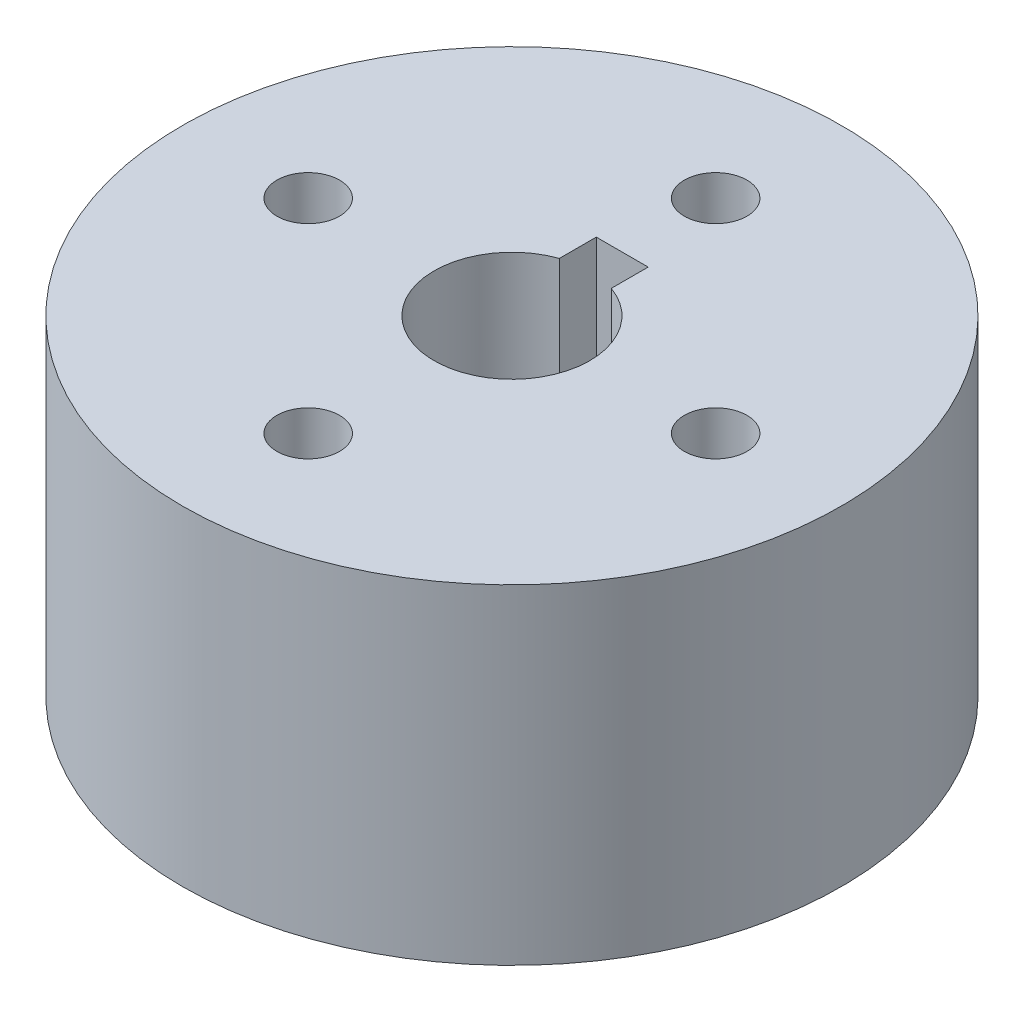
ISO-10303-21;
HEADER;
FILE_DESCRIPTION(('STEP AP214'),'2;1');
FILE_NAME('part.step','',(''),(''),'','','');
FILE_SCHEMA(('AUTOMOTIVE_DESIGN { 1 0 10303 214 1 1 1 1 }'));
ENDSEC;
DATA;
#1=APPLICATION_CONTEXT('core data for automotive mechanical design processes');
#2=APPLICATION_PROTOCOL_DEFINITION('international standard','automotive_design',2000,#1);
#3=PRODUCT_CONTEXT('',#1,'mechanical');
#4=PRODUCT('Part','Part','',(#3));
#5=PRODUCT_RELATED_PRODUCT_CATEGORY('part','',(#4));
#6=PRODUCT_DEFINITION_FORMATION('','',#4);
#7=PRODUCT_DEFINITION_CONTEXT('part definition',#1,'design');
#8=PRODUCT_DEFINITION('design','',#6,#7);
#9=PRODUCT_DEFINITION_SHAPE('','',#8);
#10=(LENGTH_UNIT() NAMED_UNIT(*) SI_UNIT(.MILLI.,.METRE.));
#11=(NAMED_UNIT(*) PLANE_ANGLE_UNIT() SI_UNIT($,.RADIAN.));
#12=(NAMED_UNIT(*) SI_UNIT($,.STERADIAN.) SOLID_ANGLE_UNIT());
#13=UNCERTAINTY_MEASURE_WITH_UNIT(LENGTH_MEASURE(1.E-05),#10,'distance_accuracy_value','');
#14=(GEOMETRIC_REPRESENTATION_CONTEXT(3) GLOBAL_UNCERTAINTY_ASSIGNED_CONTEXT((#13)) GLOBAL_UNIT_ASSIGNED_CONTEXT((#10,
#11,#12)) REPRESENTATION_CONTEXT('',''));
#15=CARTESIAN_POINT('',(0.,0.,0.));
#16=DIRECTION('',(0.,0.,1.));
#17=DIRECTION('',(1.,0.,0.));
#18=AXIS2_PLACEMENT_3D('',#15,#16,#17);
#19=CARTESIAN_POINT('',(0.,25.4,0.));
#20=DIRECTION('',(0.,1.,0.));
#21=DIRECTION('',(0.,0.,1.));
#22=AXIS2_PLACEMENT_3D('',#19,#20,#21);
#23=PLANE('',#22);
#24=CARTESIAN_POINT('',(0.,25.4,-15.7));
#25=DIRECTION('',(0.,-1.,0.));
#26=DIRECTION('',(0.,0.,-1.));
#27=AXIS2_PLACEMENT_3D('',#24,#25,#26);
#28=CIRCLE('',#27,2.413);
#29=CARTESIAN_POINT('',(0.,25.4,-18.113));
#30=VERTEX_POINT('',#29);
#31=EDGE_CURVE('E105',#30,#30,#28,.T.);
#32=ORIENTED_EDGE('',*,*,#31,.T.);
#33=EDGE_LOOP('',(#32));
#34=FACE_BOUND('',#33,.T.);
#35=CARTESIAN_POINT('',(-15.7,25.4,0.));
#36=DIRECTION('',(0.,-1.,0.));
#37=DIRECTION('',(0.,0.,-1.));
#38=AXIS2_PLACEMENT_3D('',#35,#36,#37);
#39=CIRCLE('',#38,2.413);
#40=CARTESIAN_POINT('',(-15.7,25.4,-2.413));
#41=VERTEX_POINT('',#40);
#42=EDGE_CURVE('E163',#41,#41,#39,.T.);
#43=ORIENTED_EDGE('',*,*,#42,.T.);
#44=EDGE_LOOP('',(#43));
#45=FACE_BOUND('',#44,.T.);
#46=CARTESIAN_POINT('',(0.,25.4,15.7));
#47=DIRECTION('',(0.,-1.,0.));
#48=DIRECTION('',(0.,0.,-1.));
#49=AXIS2_PLACEMENT_3D('',#46,#47,#48);
#50=CIRCLE('',#49,2.413);
#51=CARTESIAN_POINT('',(0.,25.4,13.287));
#52=VERTEX_POINT('',#51);
#53=EDGE_CURVE('E155',#52,#52,#50,.T.);
#54=ORIENTED_EDGE('',*,*,#53,.T.);
#55=EDGE_LOOP('',(#54));
#56=FACE_BOUND('',#55,.T.);
#57=CARTESIAN_POINT('',(15.7,25.4,0.));
#58=DIRECTION('',(0.,-1.,0.));
#59=DIRECTION('',(0.,0.,-1.));
#60=AXIS2_PLACEMENT_3D('',#57,#58,#59);
#61=CIRCLE('',#60,2.413);
#62=CARTESIAN_POINT('',(15.7,25.4,-2.413));
#63=VERTEX_POINT('',#62);
#64=EDGE_CURVE('E147',#63,#63,#61,.T.);
#65=ORIENTED_EDGE('',*,*,#64,.T.);
#66=EDGE_LOOP('',(#65));
#67=FACE_BOUND('',#66,.T.);
#68=DIRECTION('',(0.,0.,1.));
#69=VECTOR('',#68,1.);
#70=CARTESIAN_POINT('',(-2.,25.4,-8.5));
#71=LINE('',#70,#69);
#72=CARTESIAN_POINT('',(-2.,25.4,-8.5));
#73=VERTEX_POINT('',#72);
#74=CARTESIAN_POINT('',(-2.,25.4,-5.65685424949238));
#75=VERTEX_POINT('',#74);
#76=EDGE_CURVE('E102',#73,#75,#71,.T.);
#77=ORIENTED_EDGE('',*,*,#76,.F.);
#78=DIRECTION('',(-1.,0.,0.));
#79=VECTOR('',#78,1.);
#80=CARTESIAN_POINT('',(-2.,25.4,-8.5));
#81=LINE('',#80,#79);
#82=CARTESIAN_POINT('',(2.,25.4,-8.5));
#83=VERTEX_POINT('',#82);
#84=EDGE_CURVE('E108',#83,#73,#81,.T.);
#85=ORIENTED_EDGE('',*,*,#84,.F.);
#86=DIRECTION('',(0.,0.,-1.));
#87=VECTOR('',#86,1.);
#88=CARTESIAN_POINT('',(2.,25.4,-8.5));
#89=LINE('',#88,#87);
#90=CARTESIAN_POINT('',(2.,25.4,-5.65685424949238));
#91=VERTEX_POINT('',#90);
#92=EDGE_CURVE('E90',#91,#83,#89,.T.);
#93=ORIENTED_EDGE('',*,*,#92,.F.);
#94=CARTESIAN_POINT('',(0.,25.4,0.));
#95=DIRECTION('',(0.,1.,0.));
#96=DIRECTION('',(0.,0.,1.));
#97=AXIS2_PLACEMENT_3D('',#94,#95,#96);
#98=CIRCLE('',#97,6.);
#99=EDGE_CURVE('E114',#75,#91,#98,.T.);
#100=ORIENTED_EDGE('',*,*,#99,.F.);
#101=EDGE_LOOP('',(#77,#85,#93,#100));
#102=FACE_BOUND('',#101,.T.);
#103=CARTESIAN_POINT('',(0.,25.4,0.));
#104=DIRECTION('',(0.,1.,0.));
#105=DIRECTION('',(0.,0.,1.));
#106=AXIS2_PLACEMENT_3D('',#103,#104,#105);
#107=CIRCLE('',#106,25.4);
#108=CARTESIAN_POINT('',(0.,25.4,25.4));
#109=VERTEX_POINT('',#108);
#110=EDGE_CURVE('E122',#109,#109,#107,.T.);
#111=ORIENTED_EDGE('',*,*,#110,.T.);
#112=EDGE_LOOP('',(#111));
#113=FACE_BOUND('',#112,.T.);
#114=ADVANCED_FACE('F39',(#34,#45,#56,#67,#102,#113),#23,.T.);
#115=CARTESIAN_POINT('',(0.,0.,0.));
#116=DIRECTION('',(0.,1.,0.));
#117=DIRECTION('',(0.,0.,1.));
#118=AXIS2_PLACEMENT_3D('',#115,#116,#117);
#119=PLANE('',#118);
#120=CARTESIAN_POINT('',(0.,0.,-15.7));
#121=DIRECTION('',(0.,-1.,0.));
#122=DIRECTION('',(0.,0.,-1.));
#123=AXIS2_PLACEMENT_3D('',#120,#121,#122);
#124=CIRCLE('',#123,2.413);
#125=CARTESIAN_POINT('',(0.,0.,-18.113));
#126=VERTEX_POINT('',#125);
#127=EDGE_CURVE('E167',#126,#126,#124,.T.);
#128=ORIENTED_EDGE('',*,*,#127,.F.);
#129=EDGE_LOOP('',(#128));
#130=FACE_BOUND('',#129,.T.);
#131=CARTESIAN_POINT('',(-15.7,0.,0.));
#132=DIRECTION('',(0.,-1.,0.));
#133=DIRECTION('',(0.,0.,-1.));
#134=AXIS2_PLACEMENT_3D('',#131,#132,#133);
#135=CIRCLE('',#134,2.413);
#136=CARTESIAN_POINT('',(-15.7,0.,-2.413));
#137=VERTEX_POINT('',#136);
#138=EDGE_CURVE('E159',#137,#137,#135,.T.);
#139=ORIENTED_EDGE('',*,*,#138,.F.);
#140=EDGE_LOOP('',(#139));
#141=FACE_BOUND('',#140,.T.);
#142=CARTESIAN_POINT('',(0.,0.,15.7));
#143=DIRECTION('',(0.,-1.,0.));
#144=DIRECTION('',(0.,0.,-1.));
#145=AXIS2_PLACEMENT_3D('',#142,#143,#144);
#146=CIRCLE('',#145,2.413);
#147=CARTESIAN_POINT('',(0.,0.,13.287));
#148=VERTEX_POINT('',#147);
#149=EDGE_CURVE('E151',#148,#148,#146,.T.);
#150=ORIENTED_EDGE('',*,*,#149,.F.);
#151=EDGE_LOOP('',(#150));
#152=FACE_BOUND('',#151,.T.);
#153=CARTESIAN_POINT('',(15.7,0.,0.));
#154=DIRECTION('',(0.,-1.,0.));
#155=DIRECTION('',(0.,0.,-1.));
#156=AXIS2_PLACEMENT_3D('',#153,#154,#155);
#157=CIRCLE('',#156,2.413);
#158=CARTESIAN_POINT('',(15.7,0.,-2.413));
#159=VERTEX_POINT('',#158);
#160=EDGE_CURVE('E143',#159,#159,#157,.T.);
#161=ORIENTED_EDGE('',*,*,#160,.F.);
#162=EDGE_LOOP('',(#161));
#163=FACE_BOUND('',#162,.T.);
#164=CARTESIAN_POINT('',(0.,0.,0.));
#165=DIRECTION('',(0.,1.,0.));
#166=DIRECTION('',(0.,0.,1.));
#167=AXIS2_PLACEMENT_3D('',#164,#165,#166);
#168=CIRCLE('',#167,25.4);
#169=CARTESIAN_POINT('',(0.,0.,25.4));
#170=VERTEX_POINT('',#169);
#171=EDGE_CURVE('E118',#170,#170,#168,.T.);
#172=ORIENTED_EDGE('',*,*,#171,.F.);
#173=EDGE_LOOP('',(#172));
#174=FACE_BOUND('',#173,.T.);
#175=CARTESIAN_POINT('',(0.,0.,0.));
#176=DIRECTION('',(0.,1.,0.));
#177=DIRECTION('',(0.,0.,1.));
#178=AXIS2_PLACEMENT_3D('',#175,#176,#177);
#179=CIRCLE('',#178,6.);
#180=CARTESIAN_POINT('',(0.,0.,6.));
#181=VERTEX_POINT('',#180);
#182=EDGE_CURVE('E112',#181,#181,#179,.T.);
#183=ORIENTED_EDGE('',*,*,#182,.T.);
#184=EDGE_LOOP('',(#183));
#185=FACE_BOUND('',#184,.T.);
#186=ADVANCED_FACE('F184',(#130,#141,#152,#163,#174,#185),#119,.F.);
#187=CARTESIAN_POINT('',(0.,25.4,0.));
#188=DIRECTION('',(0.,-1.,0.));
#189=DIRECTION('',(0.,0.,-1.));
#190=AXIS2_PLACEMENT_3D('',#187,#188,#189);
#191=CYLINDRICAL_SURFACE('',#190,25.4);
#192=ORIENTED_EDGE('',*,*,#110,.F.);
#193=EDGE_LOOP('',(#192));
#194=FACE_BOUND('',#193,.T.);
#195=ORIENTED_EDGE('',*,*,#171,.T.);
#196=EDGE_LOOP('',(#195));
#197=FACE_BOUND('',#196,.T.);
#198=ADVANCED_FACE('F41',(#194,#197),#191,.T.);
#199=CARTESIAN_POINT('',(0.,25.4,0.));
#200=DIRECTION('',(0.,-1.,0.));
#201=DIRECTION('',(0.,0.,-1.));
#202=AXIS2_PLACEMENT_3D('',#199,#200,#201);
#203=CYLINDRICAL_SURFACE('',#202,6.);
#204=DIRECTION('',(0.,-1.,0.));
#205=VECTOR('',#204,1.);
#206=CARTESIAN_POINT('',(-2.,25.4,-5.65685424949238));
#207=LINE('',#206,#205);
#208=CARTESIAN_POINT('',(-2.,8.575,-5.65685424949238));
#209=VERTEX_POINT('',#208);
#210=EDGE_CURVE('E11',#75,#209,#207,.T.);
#211=ORIENTED_EDGE('',*,*,#210,.F.);
#212=ORIENTED_EDGE('',*,*,#99,.T.);
#213=DIRECTION('',(0.,-1.,0.));
#214=VECTOR('',#213,1.);
#215=CARTESIAN_POINT('',(2.,25.4,-5.65685424949238));
#216=LINE('',#215,#214);
#217=CARTESIAN_POINT('',(2.,8.575,-5.65685424949238));
#218=VERTEX_POINT('',#217);
#219=EDGE_CURVE('E48',#218,#91,#216,.F.);
#220=ORIENTED_EDGE('',*,*,#219,.F.);
#221=CARTESIAN_POINT('',(0.,8.575,0.));
#222=DIRECTION('',(0.,1.,0.));
#223=DIRECTION('',(0.,0.,1.));
#224=AXIS2_PLACEMENT_3D('',#221,#222,#223);
#225=CIRCLE('',#224,6.);
#226=EDGE_CURVE('E59',#218,#209,#225,.T.);
#227=ORIENTED_EDGE('',*,*,#226,.T.);
#228=EDGE_LOOP('',(#211,#212,#220,#227));
#229=FACE_BOUND('',#228,.T.);
#230=ORIENTED_EDGE('',*,*,#182,.F.);
#231=EDGE_LOOP('',(#230));
#232=FACE_BOUND('',#231,.T.);
#233=ADVANCED_FACE('F137',(#229,#232),#203,.F.);
#234=CARTESIAN_POINT('',(-2.,8.575,-8.5));
#235=DIRECTION('',(-1.,0.,0.));
#236=DIRECTION('',(0.,0.,1.));
#237=AXIS2_PLACEMENT_3D('',#234,#235,#236);
#238=PLANE('',#237);
#239=ORIENTED_EDGE('',*,*,#210,.T.);
#240=DIRECTION('',(0.,0.,1.));
#241=VECTOR('',#240,1.);
#242=CARTESIAN_POINT('',(-2.,8.575,-8.5));
#243=LINE('',#242,#241);
#244=CARTESIAN_POINT('',(-2.,8.575,-8.5));
#245=VERTEX_POINT('',#244);
#246=EDGE_CURVE('E55',#245,#209,#243,.T.);
#247=ORIENTED_EDGE('',*,*,#246,.F.);
#248=DIRECTION('',(0.,1.,0.));
#249=VECTOR('',#248,1.);
#250=CARTESIAN_POINT('',(-2.,8.575,-8.5));
#251=LINE('',#250,#249);
#252=EDGE_CURVE('E95',#245,#73,#251,.T.);
#253=ORIENTED_EDGE('',*,*,#252,.T.);
#254=ORIENTED_EDGE('',*,*,#76,.T.);
#255=EDGE_LOOP('',(#239,#247,#253,#254));
#256=FACE_BOUND('',#255,.T.);
#257=ADVANCED_FACE('F140',(#256),#238,.F.);
#258=CARTESIAN_POINT('',(-2.,8.575,-8.5));
#259=DIRECTION('',(0.,0.,-1.));
#260=DIRECTION('',(-1.,0.,0.));
#261=AXIS2_PLACEMENT_3D('',#258,#259,#260);
#262=PLANE('',#261);
#263=ORIENTED_EDGE('',*,*,#84,.T.);
#264=ORIENTED_EDGE('',*,*,#252,.F.);
#265=DIRECTION('',(-1.,0.,0.));
#266=VECTOR('',#265,1.);
#267=CARTESIAN_POINT('',(-2.,8.575,-8.5));
#268=LINE('',#267,#266);
#269=CARTESIAN_POINT('',(2.,8.575,-8.5));
#270=VERTEX_POINT('',#269);
#271=EDGE_CURVE('E81',#270,#245,#268,.T.);
#272=ORIENTED_EDGE('',*,*,#271,.F.);
#273=DIRECTION('',(0.,1.,0.));
#274=VECTOR('',#273,1.);
#275=CARTESIAN_POINT('',(2.,8.575,-8.5));
#276=LINE('',#275,#274);
#277=EDGE_CURVE('E87',#270,#83,#276,.T.);
#278=ORIENTED_EDGE('',*,*,#277,.T.);
#279=EDGE_LOOP('',(#263,#264,#272,#278));
#280=FACE_BOUND('',#279,.T.);
#281=ADVANCED_FACE('F97',(#280),#262,.F.);
#282=CARTESIAN_POINT('',(2.,8.575,-8.5));
#283=DIRECTION('',(1.,0.,0.));
#284=DIRECTION('',(0.,0.,-1.));
#285=AXIS2_PLACEMENT_3D('',#282,#283,#284);
#286=PLANE('',#285);
#287=ORIENTED_EDGE('',*,*,#219,.T.);
#288=ORIENTED_EDGE('',*,*,#92,.T.);
#289=ORIENTED_EDGE('',*,*,#277,.F.);
#290=DIRECTION('',(0.,0.,-1.));
#291=VECTOR('',#290,1.);
#292=CARTESIAN_POINT('',(2.,8.575,-8.5));
#293=LINE('',#292,#291);
#294=EDGE_CURVE('E77',#218,#270,#293,.T.);
#295=ORIENTED_EDGE('',*,*,#294,.F.);
#296=EDGE_LOOP('',(#287,#288,#289,#295));
#297=FACE_BOUND('',#296,.T.);
#298=ADVANCED_FACE('F88',(#297),#286,.F.);
#299=CARTESIAN_POINT('',(0.,8.575,0.));
#300=DIRECTION('',(0.,1.,0.));
#301=DIRECTION('',(0.,0.,1.));
#302=AXIS2_PLACEMENT_3D('',#299,#300,#301);
#303=PLANE('',#302);
#304=ORIENTED_EDGE('',*,*,#294,.T.);
#305=ORIENTED_EDGE('',*,*,#271,.T.);
#306=ORIENTED_EDGE('',*,*,#246,.T.);
#307=ORIENTED_EDGE('',*,*,#226,.F.);
#308=EDGE_LOOP('',(#304,#305,#306,#307));
#309=FACE_BOUND('',#308,.T.);
#310=ADVANCED_FACE('F79',(#309),#303,.T.);
#311=CARTESIAN_POINT('',(15.7,25.4,0.));
#312=DIRECTION('',(0.,-1.,0.));
#313=DIRECTION('',(0.,0.,-1.));
#314=AXIS2_PLACEMENT_3D('',#311,#312,#313);
#315=CYLINDRICAL_SURFACE('',#314,2.413);
#316=ORIENTED_EDGE('',*,*,#64,.F.);
#317=EDGE_LOOP('',(#316));
#318=FACE_BOUND('',#317,.T.);
#319=ORIENTED_EDGE('',*,*,#160,.T.);
#320=EDGE_LOOP('',(#319));
#321=FACE_BOUND('',#320,.T.);
#322=ADVANCED_FACE('F251',(#318,#321),#315,.F.);
#323=CARTESIAN_POINT('',(0.,25.4,15.7));
#324=DIRECTION('',(0.,-1.,0.));
#325=DIRECTION('',(0.,0.,-1.));
#326=AXIS2_PLACEMENT_3D('',#323,#324,#325);
#327=CYLINDRICAL_SURFACE('',#326,2.413);
#328=ORIENTED_EDGE('',*,*,#53,.F.);
#329=EDGE_LOOP('',(#328));
#330=FACE_BOUND('',#329,.T.);
#331=ORIENTED_EDGE('',*,*,#149,.T.);
#332=EDGE_LOOP('',(#331));
#333=FACE_BOUND('',#332,.T.);
#334=ADVANCED_FACE('F260',(#330,#333),#327,.F.);
#335=CARTESIAN_POINT('',(-15.7,25.4,0.));
#336=DIRECTION('',(0.,-1.,0.));
#337=DIRECTION('',(0.,0.,-1.));
#338=AXIS2_PLACEMENT_3D('',#335,#336,#337);
#339=CYLINDRICAL_SURFACE('',#338,2.413);
#340=ORIENTED_EDGE('',*,*,#42,.F.);
#341=EDGE_LOOP('',(#340));
#342=FACE_BOUND('',#341,.T.);
#343=ORIENTED_EDGE('',*,*,#138,.T.);
#344=EDGE_LOOP('',(#343));
#345=FACE_BOUND('',#344,.T.);
#346=ADVANCED_FACE('F180',(#342,#345),#339,.F.);
#347=CARTESIAN_POINT('',(0.,25.4,-15.7));
#348=DIRECTION('',(0.,-1.,0.));
#349=DIRECTION('',(0.,0.,-1.));
#350=AXIS2_PLACEMENT_3D('',#347,#348,#349);
#351=CYLINDRICAL_SURFACE('',#350,2.413);
#352=ORIENTED_EDGE('',*,*,#31,.F.);
#353=EDGE_LOOP('',(#352));
#354=FACE_BOUND('',#353,.T.);
#355=ORIENTED_EDGE('',*,*,#127,.T.);
#356=EDGE_LOOP('',(#355));
#357=FACE_BOUND('',#356,.T.);
#358=ADVANCED_FACE('F177',(#354,#357),#351,.F.);
#359=CLOSED_SHELL('',(#114,#186,#198,#233,#257,#281,#298,#310,#322,#334,#346,#358));
#360=MANIFOLD_SOLID_BREP('B2',#359);
#361=ADVANCED_BREP_SHAPE_REPRESENTATION('',(#18,#360),#14);
#362=SHAPE_DEFINITION_REPRESENTATION(#9,#361);
ENDSEC;
END-ISO-10303-21;
